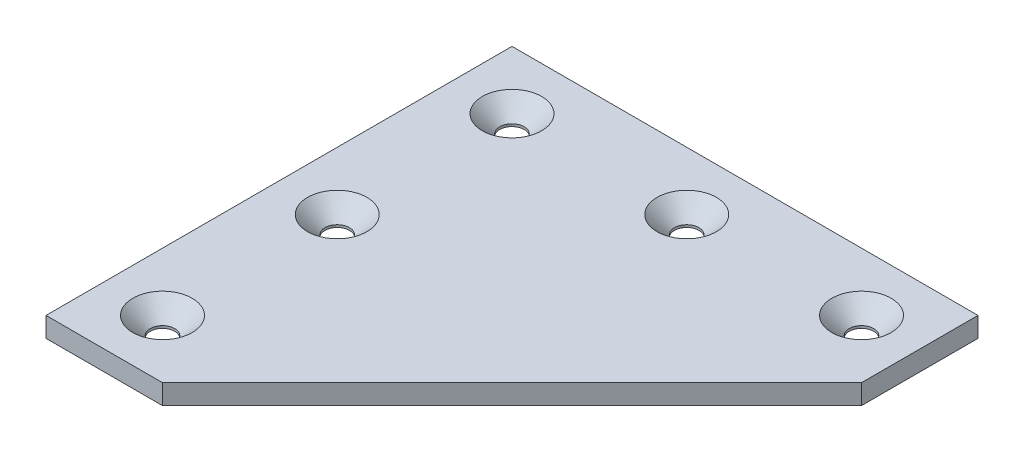
ISO-10303-21;
HEADER;
FILE_DESCRIPTION(('STEP AP214'),'2;1');
FILE_NAME('part.step','',(''),(''),'','','');
FILE_SCHEMA(('AUTOMOTIVE_DESIGN { 1 0 10303 214 1 1 1 1 }'));
ENDSEC;
DATA;
#1=APPLICATION_CONTEXT('core data for automotive mechanical design processes');
#2=APPLICATION_PROTOCOL_DEFINITION('international standard','automotive_design',2000,#1);
#3=PRODUCT_CONTEXT('',#1,'mechanical');
#4=PRODUCT('Part','Part','',(#3));
#5=PRODUCT_RELATED_PRODUCT_CATEGORY('part','',(#4));
#6=PRODUCT_DEFINITION_FORMATION('','',#4);
#7=PRODUCT_DEFINITION_CONTEXT('part definition',#1,'design');
#8=PRODUCT_DEFINITION('design','',#6,#7);
#9=PRODUCT_DEFINITION_SHAPE('','',#8);
#10=(LENGTH_UNIT() NAMED_UNIT(*) SI_UNIT(.MILLI.,.METRE.));
#11=(NAMED_UNIT(*) PLANE_ANGLE_UNIT() SI_UNIT($,.RADIAN.));
#12=(NAMED_UNIT(*) SI_UNIT($,.STERADIAN.) SOLID_ANGLE_UNIT());
#13=UNCERTAINTY_MEASURE_WITH_UNIT(LENGTH_MEASURE(1.E-05),#10,'distance_accuracy_value','');
#14=(GEOMETRIC_REPRESENTATION_CONTEXT(3) GLOBAL_UNCERTAINTY_ASSIGNED_CONTEXT((#13)) GLOBAL_UNIT_ASSIGNED_CONTEXT((#10,
#11,#12)) REPRESENTATION_CONTEXT('',''));
#15=CARTESIAN_POINT('',(0.,0.,0.));
#16=DIRECTION('',(0.,0.,1.));
#17=DIRECTION('',(1.,0.,0.));
#18=AXIS2_PLACEMENT_3D('',#15,#16,#17);
#19=CARTESIAN_POINT('',(80.,3.416,0.));
#20=DIRECTION('',(0.,0.,1.));
#21=DIRECTION('',(-1.,0.,0.));
#22=AXIS2_PLACEMENT_3D('',#19,#20,#21);
#23=PLANE('',#22);
#24=DIRECTION('',(1.,0.,0.));
#25=VECTOR('',#24,1.);
#26=CARTESIAN_POINT('',(80.,0.,0.));
#27=LINE('',#26,#25);
#28=CARTESIAN_POINT('',(0.,0.,0.));
#29=VERTEX_POINT('',#28);
#30=CARTESIAN_POINT('',(80.,0.,0.));
#31=VERTEX_POINT('',#30);
#32=EDGE_CURVE('E118',#29,#31,#27,.T.);
#33=ORIENTED_EDGE('',*,*,#32,.F.);
#34=DIRECTION('',(0.,-1.,0.));
#35=VECTOR('',#34,1.);
#36=CARTESIAN_POINT('',(0.,3.416,0.));
#37=LINE('',#36,#35);
#38=CARTESIAN_POINT('',(0.,3.416,0.));
#39=VERTEX_POINT('',#38);
#40=EDGE_CURVE('E117',#39,#29,#37,.T.);
#41=ORIENTED_EDGE('',*,*,#40,.F.);
#42=DIRECTION('',(1.,0.,0.));
#43=VECTOR('',#42,1.);
#44=CARTESIAN_POINT('',(80.,3.416,0.));
#45=LINE('',#44,#43);
#46=CARTESIAN_POINT('',(80.,3.416,0.));
#47=VERTEX_POINT('',#46);
#48=EDGE_CURVE('E112',#39,#47,#45,.T.);
#49=ORIENTED_EDGE('',*,*,#48,.T.);
#50=DIRECTION('',(0.,-1.,0.));
#51=VECTOR('',#50,1.);
#52=CARTESIAN_POINT('',(80.,3.416,0.));
#53=LINE('',#52,#51);
#54=EDGE_CURVE('E131',#47,#31,#53,.T.);
#55=ORIENTED_EDGE('',*,*,#54,.T.);
#56=EDGE_LOOP('',(#33,#41,#49,#55));
#57=FACE_BOUND('',#56,.T.);
#58=ADVANCED_FACE('F41',(#57),#23,.F.);
#59=CARTESIAN_POINT('',(80.,3.416,20.));
#60=DIRECTION('',(-1.,0.,0.));
#61=DIRECTION('',(0.,0.,-1.));
#62=AXIS2_PLACEMENT_3D('',#59,#60,#61);
#63=PLANE('',#62);
#64=DIRECTION('',(0.,0.,1.));
#65=VECTOR('',#64,1.);
#66=CARTESIAN_POINT('',(80.,0.,20.));
#67=LINE('',#66,#65);
#68=CARTESIAN_POINT('',(80.,0.,20.));
#69=VERTEX_POINT('',#68);
#70=EDGE_CURVE('E120',#31,#69,#67,.T.);
#71=ORIENTED_EDGE('',*,*,#70,.F.);
#72=ORIENTED_EDGE('',*,*,#54,.F.);
#73=DIRECTION('',(0.,0.,1.));
#74=VECTOR('',#73,1.);
#75=CARTESIAN_POINT('',(80.,3.416,20.));
#76=LINE('',#75,#74);
#77=CARTESIAN_POINT('',(80.,3.416,20.));
#78=VERTEX_POINT('',#77);
#79=EDGE_CURVE('E87',#47,#78,#76,.T.);
#80=ORIENTED_EDGE('',*,*,#79,.T.);
#81=DIRECTION('',(0.,-1.,0.));
#82=VECTOR('',#81,1.);
#83=CARTESIAN_POINT('',(80.,3.416,20.));
#84=LINE('',#83,#82);
#85=EDGE_CURVE('E106',#78,#69,#84,.T.);
#86=ORIENTED_EDGE('',*,*,#85,.T.);
#87=EDGE_LOOP('',(#71,#72,#80,#86));
#88=FACE_BOUND('',#87,.T.);
#89=ADVANCED_FACE('F200',(#88),#63,.F.);
#90=CARTESIAN_POINT('',(20.,3.416,79.9999999999998));
#91=DIRECTION('',(-0.707106781186546,0.,-0.707106781186549));
#92=DIRECTION('',(0.707106781186549,0.,-0.707106781186546));
#93=AXIS2_PLACEMENT_3D('',#90,#91,#92);
#94=PLANE('',#93);
#95=DIRECTION('',(-0.707106781186549,0.,0.707106781186546));
#96=VECTOR('',#95,1.);
#97=CARTESIAN_POINT('',(20.,0.,79.9999999999998));
#98=LINE('',#97,#96);
#99=CARTESIAN_POINT('',(20.,0.,79.9999999999998));
#100=VERTEX_POINT('',#99);
#101=EDGE_CURVE('E124',#69,#100,#98,.T.);
#102=ORIENTED_EDGE('',*,*,#101,.F.);
#103=ORIENTED_EDGE('',*,*,#85,.F.);
#104=DIRECTION('',(-0.707106781186549,0.,0.707106781186546));
#105=VECTOR('',#104,1.);
#106=CARTESIAN_POINT('',(20.,3.416,79.9999999999998));
#107=LINE('',#106,#105);
#108=CARTESIAN_POINT('',(20.,3.416,79.9999999999998));
#109=VERTEX_POINT('',#108);
#110=EDGE_CURVE('E96',#78,#109,#107,.T.);
#111=ORIENTED_EDGE('',*,*,#110,.T.);
#112=DIRECTION('',(0.,-1.,0.));
#113=VECTOR('',#112,1.);
#114=CARTESIAN_POINT('',(20.,3.416,79.9999999999998));
#115=LINE('',#114,#113);
#116=EDGE_CURVE('E101',#109,#100,#115,.T.);
#117=ORIENTED_EDGE('',*,*,#116,.T.);
#118=EDGE_LOOP('',(#102,#103,#111,#117));
#119=FACE_BOUND('',#118,.T.);
#120=ADVANCED_FACE('F109',(#119),#94,.F.);
#121=CARTESIAN_POINT('',(0.,3.416,79.9999999999998));
#122=DIRECTION('',(0.,0.,-1.));
#123=DIRECTION('',(1.,0.,0.));
#124=AXIS2_PLACEMENT_3D('',#121,#122,#123);
#125=PLANE('',#124);
#126=DIRECTION('',(-1.,0.,0.));
#127=VECTOR('',#126,1.);
#128=CARTESIAN_POINT('',(0.,0.,79.9999999999998));
#129=LINE('',#128,#127);
#130=CARTESIAN_POINT('',(0.,0.,79.9999999999998));
#131=VERTEX_POINT('',#130);
#132=EDGE_CURVE('E103',#100,#131,#129,.T.);
#133=ORIENTED_EDGE('',*,*,#132,.F.);
#134=ORIENTED_EDGE('',*,*,#116,.F.);
#135=DIRECTION('',(-1.,0.,0.));
#136=VECTOR('',#135,1.);
#137=CARTESIAN_POINT('',(0.,3.416,79.9999999999998));
#138=LINE('',#137,#136);
#139=CARTESIAN_POINT('',(0.,3.416,79.9999999999998));
#140=VERTEX_POINT('',#139);
#141=EDGE_CURVE('E92',#109,#140,#138,.T.);
#142=ORIENTED_EDGE('',*,*,#141,.T.);
#143=DIRECTION('',(0.,-1.,0.));
#144=VECTOR('',#143,1.);
#145=CARTESIAN_POINT('',(0.,3.416,79.9999999999998));
#146=LINE('',#145,#144);
#147=EDGE_CURVE('E107',#140,#131,#146,.T.);
#148=ORIENTED_EDGE('',*,*,#147,.T.);
#149=EDGE_LOOP('',(#133,#134,#142,#148));
#150=FACE_BOUND('',#149,.T.);
#151=ADVANCED_FACE('F102',(#150),#125,.F.);
#152=CARTESIAN_POINT('',(0.,3.416,0.));
#153=DIRECTION('',(1.,0.,0.));
#154=DIRECTION('',(0.,0.,1.));
#155=AXIS2_PLACEMENT_3D('',#152,#153,#154);
#156=PLANE('',#155);
#157=DIRECTION('',(0.,0.,-1.));
#158=VECTOR('',#157,1.);
#159=CARTESIAN_POINT('',(0.,0.,0.));
#160=LINE('',#159,#158);
#161=EDGE_CURVE('E75',#131,#29,#160,.T.);
#162=ORIENTED_EDGE('',*,*,#161,.F.);
#163=ORIENTED_EDGE('',*,*,#147,.F.);
#164=DIRECTION('',(0.,0.,-1.));
#165=VECTOR('',#164,1.);
#166=CARTESIAN_POINT('',(0.,3.416,0.));
#167=LINE('',#166,#165);
#168=EDGE_CURVE('E58',#140,#39,#167,.T.);
#169=ORIENTED_EDGE('',*,*,#168,.T.);
#170=ORIENTED_EDGE('',*,*,#40,.T.);
#171=EDGE_LOOP('',(#162,#163,#169,#170));
#172=FACE_BOUND('',#171,.T.);
#173=ADVANCED_FACE('F232',(#172),#156,.F.);
#174=CARTESIAN_POINT('',(0.,3.416,0.));
#175=DIRECTION('',(0.,-1.,0.));
#176=DIRECTION('',(0.,0.,1.));
#177=AXIS2_PLACEMENT_3D('',#174,#175,#176);
#178=PLANE('',#177);
#179=CARTESIAN_POINT('',(70.,3.416,10.));
#180=DIRECTION('',(0.,1.,0.));
#181=DIRECTION('',(0.,0.,1.));
#182=AXIS2_PLACEMENT_3D('',#179,#180,#181);
#183=CIRCLE('',#182,5.10000000000001);
#184=CARTESIAN_POINT('',(70.,3.416,15.1));
#185=VERTEX_POINT('',#184);
#186=EDGE_CURVE('E163',#185,#185,#183,.T.);
#187=ORIENTED_EDGE('',*,*,#186,.F.);
#188=EDGE_LOOP('',(#187));
#189=FACE_BOUND('',#188,.T.);
#190=CARTESIAN_POINT('',(40.,3.416,10.));
#191=DIRECTION('',(0.,1.,0.));
#192=DIRECTION('',(0.,0.,1.));
#193=AXIS2_PLACEMENT_3D('',#190,#191,#192);
#194=CIRCLE('',#193,5.10000000000001);
#195=CARTESIAN_POINT('',(40.,3.416,15.1));
#196=VERTEX_POINT('',#195);
#197=EDGE_CURVE('E160',#196,#196,#194,.T.);
#198=ORIENTED_EDGE('',*,*,#197,.F.);
#199=EDGE_LOOP('',(#198));
#200=FACE_BOUND('',#199,.T.);
#201=CARTESIAN_POINT('',(10.,3.416,10.));
#202=DIRECTION('',(0.,1.,0.));
#203=DIRECTION('',(0.,0.,1.));
#204=AXIS2_PLACEMENT_3D('',#201,#202,#203);
#205=CIRCLE('',#204,5.10000000000002);
#206=CARTESIAN_POINT('',(10.,3.416,15.1));
#207=VERTEX_POINT('',#206);
#208=EDGE_CURVE('E157',#207,#207,#205,.T.);
#209=ORIENTED_EDGE('',*,*,#208,.F.);
#210=EDGE_LOOP('',(#209));
#211=FACE_BOUND('',#210,.T.);
#212=CARTESIAN_POINT('',(9.9999999999999,3.416,40.));
#213=DIRECTION('',(0.,1.,0.));
#214=DIRECTION('',(0.,0.,1.));
#215=AXIS2_PLACEMENT_3D('',#212,#213,#214);
#216=CIRCLE('',#215,5.10000000000001);
#217=CARTESIAN_POINT('',(9.9999999999999,3.416,45.1));
#218=VERTEX_POINT('',#217);
#219=EDGE_CURVE('E154',#218,#218,#216,.T.);
#220=ORIENTED_EDGE('',*,*,#219,.F.);
#221=EDGE_LOOP('',(#220));
#222=FACE_BOUND('',#221,.T.);
#223=CARTESIAN_POINT('',(9.99999999999979,3.416,70.));
#224=DIRECTION('',(0.,1.,0.));
#225=DIRECTION('',(0.,0.,1.));
#226=AXIS2_PLACEMENT_3D('',#223,#224,#225);
#227=CIRCLE('',#226,5.10000000000001);
#228=CARTESIAN_POINT('',(9.99999999999979,3.416,64.9));
#229=VERTEX_POINT('',#228);
#230=EDGE_CURVE('E151',#229,#229,#227,.T.);
#231=ORIENTED_EDGE('',*,*,#230,.F.);
#232=EDGE_LOOP('',(#231));
#233=FACE_BOUND('',#232,.T.);
#234=ORIENTED_EDGE('',*,*,#48,.F.);
#235=ORIENTED_EDGE('',*,*,#168,.F.);
#236=ORIENTED_EDGE('',*,*,#141,.F.);
#237=ORIENTED_EDGE('',*,*,#110,.F.);
#238=ORIENTED_EDGE('',*,*,#79,.F.);
#239=EDGE_LOOP('',(#234,#235,#236,#237,#238));
#240=FACE_BOUND('',#239,.T.);
#241=ADVANCED_FACE('F94',(#189,#200,#211,#222,#233,#240),#178,.F.);
#242=CARTESIAN_POINT('',(0.,0.,0.));
#243=DIRECTION('',(0.,-1.,0.));
#244=DIRECTION('',(0.,0.,1.));
#245=AXIS2_PLACEMENT_3D('',#242,#243,#244);
#246=PLANE('',#245);
#247=CARTESIAN_POINT('',(9.99999999999979,0.,70.));
#248=DIRECTION('',(0.,1.,0.));
#249=DIRECTION('',(0.,0.,1.));
#250=AXIS2_PLACEMENT_3D('',#247,#248,#249);
#251=CIRCLE('',#250,2.1);
#252=CARTESIAN_POINT('',(9.99999999999979,0.,72.1));
#253=VERTEX_POINT('',#252);
#254=EDGE_CURVE('E121',#253,#253,#251,.T.);
#255=ORIENTED_EDGE('',*,*,#254,.T.);
#256=EDGE_LOOP('',(#255));
#257=FACE_BOUND('',#256,.T.);
#258=CARTESIAN_POINT('',(9.9999999999999,0.,40.));
#259=DIRECTION('',(0.,1.,0.));
#260=DIRECTION('',(0.,0.,1.));
#261=AXIS2_PLACEMENT_3D('',#258,#259,#260);
#262=CIRCLE('',#261,2.1);
#263=CARTESIAN_POINT('',(9.9999999999999,0.,42.1));
#264=VERTEX_POINT('',#263);
#265=EDGE_CURVE('E144',#264,#264,#262,.T.);
#266=ORIENTED_EDGE('',*,*,#265,.T.);
#267=EDGE_LOOP('',(#266));
#268=FACE_BOUND('',#267,.T.);
#269=CARTESIAN_POINT('',(70.,0.,10.));
#270=DIRECTION('',(0.,1.,0.));
#271=DIRECTION('',(0.,0.,1.));
#272=AXIS2_PLACEMENT_3D('',#269,#270,#271);
#273=CIRCLE('',#272,2.1);
#274=CARTESIAN_POINT('',(70.,0.,12.1));
#275=VERTEX_POINT('',#274);
#276=EDGE_CURVE('E141',#275,#275,#273,.T.);
#277=ORIENTED_EDGE('',*,*,#276,.T.);
#278=EDGE_LOOP('',(#277));
#279=FACE_BOUND('',#278,.T.);
#280=CARTESIAN_POINT('',(10.,0.,10.));
#281=DIRECTION('',(0.,1.,0.));
#282=DIRECTION('',(0.,0.,1.));
#283=AXIS2_PLACEMENT_3D('',#280,#281,#282);
#284=CIRCLE('',#283,2.1);
#285=CARTESIAN_POINT('',(10.,0.,12.1));
#286=VERTEX_POINT('',#285);
#287=EDGE_CURVE('E138',#286,#286,#284,.T.);
#288=ORIENTED_EDGE('',*,*,#287,.T.);
#289=EDGE_LOOP('',(#288));
#290=FACE_BOUND('',#289,.T.);
#291=CARTESIAN_POINT('',(40.,0.,10.));
#292=DIRECTION('',(0.,1.,0.));
#293=DIRECTION('',(0.,0.,1.));
#294=AXIS2_PLACEMENT_3D('',#291,#292,#293);
#295=CIRCLE('',#294,2.1);
#296=CARTESIAN_POINT('',(40.,0.,12.1));
#297=VERTEX_POINT('',#296);
#298=EDGE_CURVE('E135',#297,#297,#295,.T.);
#299=ORIENTED_EDGE('',*,*,#298,.T.);
#300=EDGE_LOOP('',(#299));
#301=FACE_BOUND('',#300,.T.);
#302=ORIENTED_EDGE('',*,*,#32,.T.);
#303=ORIENTED_EDGE('',*,*,#70,.T.);
#304=ORIENTED_EDGE('',*,*,#101,.T.);
#305=ORIENTED_EDGE('',*,*,#132,.T.);
#306=ORIENTED_EDGE('',*,*,#161,.T.);
#307=EDGE_LOOP('',(#302,#303,#304,#305,#306));
#308=FACE_BOUND('',#307,.T.);
#309=ADVANCED_FACE('F184',(#257,#268,#279,#290,#301,#308),#246,.T.);
#310=CARTESIAN_POINT('',(40.,-0.584,10.));
#311=DIRECTION('',(0.,1.,0.));
#312=DIRECTION('',(0.,0.,-1.));
#313=AXIS2_PLACEMENT_3D('',#310,#311,#312);
#314=CYLINDRICAL_SURFACE('',#313,2.1);
#315=CARTESIAN_POINT('',(40.,0.415999999999996,10.));
#316=DIRECTION('',(0.,1.,0.));
#317=DIRECTION('',(0.,0.,1.));
#318=AXIS2_PLACEMENT_3D('',#315,#316,#317);
#319=CIRCLE('',#318,2.1);
#320=CARTESIAN_POINT('',(40.,0.415999999999996,12.1));
#321=VERTEX_POINT('',#320);
#322=EDGE_CURVE('E166',#321,#321,#319,.F.);
#323=ORIENTED_EDGE('',*,*,#322,.F.);
#324=EDGE_LOOP('',(#323));
#325=FACE_BOUND('',#324,.T.);
#326=ORIENTED_EDGE('',*,*,#298,.F.);
#327=EDGE_LOOP('',(#326));
#328=FACE_BOUND('',#327,.T.);
#329=ADVANCED_FACE('F187',(#325,#328),#314,.F.);
#330=CARTESIAN_POINT('',(10.,-0.584,10.));
#331=DIRECTION('',(0.,1.,0.));
#332=DIRECTION('',(0.,0.,-1.));
#333=AXIS2_PLACEMENT_3D('',#330,#331,#332);
#334=CYLINDRICAL_SURFACE('',#333,2.1);
#335=CARTESIAN_POINT('',(10.,0.415999999999984,10.));
#336=DIRECTION('',(0.,1.,0.));
#337=DIRECTION('',(0.,0.,1.));
#338=AXIS2_PLACEMENT_3D('',#335,#336,#337);
#339=CIRCLE('',#338,2.1);
#340=CARTESIAN_POINT('',(10.,0.415999999999984,12.1));
#341=VERTEX_POINT('',#340);
#342=EDGE_CURVE('E169',#341,#341,#339,.F.);
#343=ORIENTED_EDGE('',*,*,#342,.F.);
#344=EDGE_LOOP('',(#343));
#345=FACE_BOUND('',#344,.T.);
#346=ORIENTED_EDGE('',*,*,#287,.F.);
#347=EDGE_LOOP('',(#346));
#348=FACE_BOUND('',#347,.T.);
#349=ADVANCED_FACE('F248',(#345,#348),#334,.F.);
#350=CARTESIAN_POINT('',(70.,-0.584,10.));
#351=DIRECTION('',(0.,1.,0.));
#352=DIRECTION('',(0.,0.,-1.));
#353=AXIS2_PLACEMENT_3D('',#350,#351,#352);
#354=CYLINDRICAL_SURFACE('',#353,2.1);
#355=CARTESIAN_POINT('',(70.,0.416000000000003,10.));
#356=DIRECTION('',(0.,1.,0.));
#357=DIRECTION('',(0.,0.,1.));
#358=AXIS2_PLACEMENT_3D('',#355,#356,#357);
#359=CIRCLE('',#358,2.1);
#360=CARTESIAN_POINT('',(70.,0.416000000000003,12.1));
#361=VERTEX_POINT('',#360);
#362=EDGE_CURVE('E134',#361,#361,#359,.F.);
#363=ORIENTED_EDGE('',*,*,#362,.F.);
#364=EDGE_LOOP('',(#363));
#365=FACE_BOUND('',#364,.T.);
#366=ORIENTED_EDGE('',*,*,#276,.F.);
#367=EDGE_LOOP('',(#366));
#368=FACE_BOUND('',#367,.T.);
#369=ADVANCED_FACE('F180',(#365,#368),#354,.F.);
#370=CARTESIAN_POINT('',(9.9999999999999,-0.584,40.));
#371=DIRECTION('',(0.,1.,0.));
#372=DIRECTION('',(0.,0.,-1.));
#373=AXIS2_PLACEMENT_3D('',#370,#371,#372);
#374=CYLINDRICAL_SURFACE('',#373,2.1);
#375=CARTESIAN_POINT('',(9.9999999999999,0.415999999999997,40.));
#376=DIRECTION('',(0.,1.,0.));
#377=DIRECTION('',(0.,0.,1.));
#378=AXIS2_PLACEMENT_3D('',#375,#376,#377);
#379=CIRCLE('',#378,2.1);
#380=CARTESIAN_POINT('',(9.9999999999999,0.415999999999997,42.1));
#381=VERTEX_POINT('',#380);
#382=EDGE_CURVE('E50',#381,#381,#379,.F.);
#383=ORIENTED_EDGE('',*,*,#382,.F.);
#384=EDGE_LOOP('',(#383));
#385=FACE_BOUND('',#384,.T.);
#386=ORIENTED_EDGE('',*,*,#265,.F.);
#387=EDGE_LOOP('',(#386));
#388=FACE_BOUND('',#387,.T.);
#389=ADVANCED_FACE('F176',(#385,#388),#374,.F.);
#390=CARTESIAN_POINT('',(9.99999999999979,-0.584,70.));
#391=DIRECTION('',(0.,1.,0.));
#392=DIRECTION('',(0.,0.,-1.));
#393=AXIS2_PLACEMENT_3D('',#390,#391,#392);
#394=CYLINDRICAL_SURFACE('',#393,2.1);
#395=CARTESIAN_POINT('',(9.99999999999979,0.415999999999999,70.));
#396=DIRECTION('',(0.,1.,0.));
#397=DIRECTION('',(0.,0.,1.));
#398=AXIS2_PLACEMENT_3D('',#395,#396,#397);
#399=CIRCLE('',#398,2.1);
#400=CARTESIAN_POINT('',(9.99999999999979,0.415999999999999,67.9));
#401=VERTEX_POINT('',#400);
#402=EDGE_CURVE('E11',#401,#401,#399,.F.);
#403=ORIENTED_EDGE('',*,*,#402,.F.);
#404=EDGE_LOOP('',(#403));
#405=FACE_BOUND('',#404,.T.);
#406=ORIENTED_EDGE('',*,*,#254,.F.);
#407=EDGE_LOOP('',(#406));
#408=FACE_BOUND('',#407,.T.);
#409=ADVANCED_FACE('F179',(#405,#408),#394,.F.);
#410=CARTESIAN_POINT('',(70.,0.416000000000003,10.));
#411=DIRECTION('',(0.,1.,0.));
#412=DIRECTION('',(0.,0.,-1.));
#413=AXIS2_PLACEMENT_3D('',#410,#411,#412);
#414=CONICAL_SURFACE('',#413,2.1,0.785398163397449);
#415=ORIENTED_EDGE('',*,*,#186,.T.);
#416=EDGE_LOOP('',(#415));
#417=FACE_BOUND('',#416,.T.);
#418=ORIENTED_EDGE('',*,*,#362,.T.);
#419=EDGE_LOOP('',(#418));
#420=FACE_BOUND('',#419,.T.);
#421=ADVANCED_FACE('F211',(#417,#420),#414,.F.);
#422=CARTESIAN_POINT('',(40.,0.415999999999996,10.));
#423=DIRECTION('',(0.,1.,0.));
#424=DIRECTION('',(0.,0.,-1.));
#425=AXIS2_PLACEMENT_3D('',#422,#423,#424);
#426=CONICAL_SURFACE('',#425,2.1,0.785398163397449);
#427=ORIENTED_EDGE('',*,*,#197,.T.);
#428=EDGE_LOOP('',(#427));
#429=FACE_BOUND('',#428,.T.);
#430=ORIENTED_EDGE('',*,*,#322,.T.);
#431=EDGE_LOOP('',(#430));
#432=FACE_BOUND('',#431,.T.);
#433=ADVANCED_FACE('F214',(#429,#432),#426,.F.);
#434=CARTESIAN_POINT('',(10.,0.415999999999984,10.));
#435=DIRECTION('',(0.,1.,0.));
#436=DIRECTION('',(0.,0.,-1.));
#437=AXIS2_PLACEMENT_3D('',#434,#435,#436);
#438=CONICAL_SURFACE('',#437,2.1,0.78539816339745);
#439=ORIENTED_EDGE('',*,*,#208,.T.);
#440=EDGE_LOOP('',(#439));
#441=FACE_BOUND('',#440,.T.);
#442=ORIENTED_EDGE('',*,*,#342,.T.);
#443=EDGE_LOOP('',(#442));
#444=FACE_BOUND('',#443,.T.);
#445=ADVANCED_FACE('F218',(#441,#444),#438,.F.);
#446=CARTESIAN_POINT('',(9.9999999999999,0.415999999999997,40.));
#447=DIRECTION('',(0.,1.,0.));
#448=DIRECTION('',(0.,0.,-1.));
#449=AXIS2_PLACEMENT_3D('',#446,#447,#448);
#450=CONICAL_SURFACE('',#449,2.1,0.785398163397449);
#451=ORIENTED_EDGE('',*,*,#219,.T.);
#452=EDGE_LOOP('',(#451));
#453=FACE_BOUND('',#452,.T.);
#454=ORIENTED_EDGE('',*,*,#382,.T.);
#455=EDGE_LOOP('',(#454));
#456=FACE_BOUND('',#455,.T.);
#457=ADVANCED_FACE('F174',(#453,#456),#450,.F.);
#458=CARTESIAN_POINT('',(9.99999999999979,0.415999999999999,70.));
#459=DIRECTION('',(0.,1.,0.));
#460=DIRECTION('',(0.,0.,-1.));
#461=AXIS2_PLACEMENT_3D('',#458,#459,#460);
#462=CONICAL_SURFACE('',#461,2.1,0.785398163397449);
#463=CARTESIAN_POINT('',(9.99999999999979,3.416,64.9));
#464=CARTESIAN_POINT('',(9.99999999999979,3.38475,64.93125));
#465=CARTESIAN_POINT('',(9.99999999999979,3.3535,64.9625));
#466=CARTESIAN_POINT('',(9.99999999999979,3.291,65.025));
#467=CARTESIAN_POINT('',(9.99999999999979,3.25975,65.05625));
#468=CARTESIAN_POINT('',(9.99999999999979,3.19725,65.11875));
#469=CARTESIAN_POINT('',(9.99999999999979,3.166,65.15));
#470=CARTESIAN_POINT('',(9.99999999999979,3.1035,65.2125));
#471=CARTESIAN_POINT('',(9.99999999999979,3.07225,65.24375));
#472=CARTESIAN_POINT('',(9.99999999999979,3.00975,65.30625));
#473=CARTESIAN_POINT('',(9.99999999999979,2.9785,65.3375));
#474=CARTESIAN_POINT('',(9.99999999999979,2.916,65.4));
#475=CARTESIAN_POINT('',(9.99999999999979,2.88475,65.43125));
#476=CARTESIAN_POINT('',(9.99999999999979,2.82225,65.49375));
#477=CARTESIAN_POINT('',(9.99999999999979,2.791,65.525));
#478=CARTESIAN_POINT('',(9.99999999999979,2.7285,65.5875));
#479=CARTESIAN_POINT('',(9.99999999999979,2.69725,65.61875));
#480=CARTESIAN_POINT('',(9.99999999999979,2.63475,65.68125));
#481=CARTESIAN_POINT('',(9.99999999999979,2.6035,65.7125));
#482=CARTESIAN_POINT('',(9.99999999999979,2.541,65.775));
#483=CARTESIAN_POINT('',(9.99999999999979,2.50975,65.80625));
#484=CARTESIAN_POINT('',(9.99999999999979,2.44725,65.86875));
#485=CARTESIAN_POINT('',(9.99999999999979,2.416,65.9));
#486=CARTESIAN_POINT('',(9.99999999999979,2.3535,65.9625));
#487=CARTESIAN_POINT('',(9.99999999999979,2.32225,65.99375));
#488=CARTESIAN_POINT('',(9.99999999999979,2.25975,66.05625));
#489=CARTESIAN_POINT('',(9.99999999999979,2.2285,66.0875));
#490=CARTESIAN_POINT('',(9.99999999999979,2.166,66.15));
#491=CARTESIAN_POINT('',(9.99999999999979,2.13475,66.18125));
#492=CARTESIAN_POINT('',(9.99999999999979,2.07225,66.24375));
#493=CARTESIAN_POINT('',(9.99999999999979,2.041,66.275));
#494=CARTESIAN_POINT('',(9.99999999999979,1.9785,66.3375));
#495=CARTESIAN_POINT('',(9.99999999999979,1.94725,66.36875));
#496=CARTESIAN_POINT('',(9.99999999999979,1.88475,66.43125));
#497=CARTESIAN_POINT('',(9.99999999999979,1.8535,66.4625));
#498=CARTESIAN_POINT('',(9.99999999999979,1.791,66.525));
#499=CARTESIAN_POINT('',(9.99999999999979,1.75975,66.55625));
#500=CARTESIAN_POINT('',(9.99999999999979,1.69725,66.61875));
#501=CARTESIAN_POINT('',(9.99999999999979,1.666,66.65));
#502=CARTESIAN_POINT('',(9.99999999999979,1.6035,66.7125));
#503=CARTESIAN_POINT('',(9.99999999999979,1.57225,66.74375));
#504=CARTESIAN_POINT('',(9.99999999999979,1.50975,66.80625));
#505=CARTESIAN_POINT('',(9.99999999999979,1.4785,66.8375));
#506=CARTESIAN_POINT('',(9.99999999999979,1.416,66.9));
#507=CARTESIAN_POINT('',(9.99999999999979,1.38475,66.93125));
#508=CARTESIAN_POINT('',(9.99999999999979,1.32225,66.99375));
#509=CARTESIAN_POINT('',(9.99999999999979,1.291,67.025));
#510=CARTESIAN_POINT('',(9.99999999999979,1.2285,67.0875));
#511=CARTESIAN_POINT('',(9.99999999999979,1.19725,67.11875));
#512=CARTESIAN_POINT('',(9.99999999999979,1.13475,67.18125));
#513=CARTESIAN_POINT('',(9.99999999999979,1.1035,67.2125));
#514=CARTESIAN_POINT('',(9.99999999999979,1.041,67.275));
#515=CARTESIAN_POINT('',(9.99999999999979,1.00975,67.30625));
#516=CARTESIAN_POINT('',(9.99999999999979,0.94725,67.36875));
#517=CARTESIAN_POINT('',(9.99999999999979,0.916000000000001,67.4));
#518=CARTESIAN_POINT('',(9.99999999999979,0.8535,67.4625));
#519=CARTESIAN_POINT('',(9.99999999999979,0.822249999999999,67.49375));
#520=CARTESIAN_POINT('',(9.99999999999979,0.759749999999998,67.55625));
#521=CARTESIAN_POINT('',(9.99999999999979,0.728499999999999,67.5875));
#522=CARTESIAN_POINT('',(9.99999999999979,0.666,67.65));
#523=CARTESIAN_POINT('',(9.99999999999979,0.634749999999999,67.68125));
#524=CARTESIAN_POINT('',(9.99999999999979,0.572249999999999,67.74375));
#525=CARTESIAN_POINT('',(9.99999999999979,0.541,67.775));
#526=CARTESIAN_POINT('',(9.99999999999979,0.478500000000001,67.8375));
#527=CARTESIAN_POINT('',(9.99999999999979,0.447250000000002,67.86875));
#528=CARTESIAN_POINT('',(9.99999999999979,0.415999999999999,67.9));
#529=B_SPLINE_CURVE_WITH_KNOTS('',3,(#463,#464,#465,#466,#467,#468,#469,#470,#471,#472,#473,
#474,#475,#476,#477,#478,#479,#480,#481,#482,#483,#484,#485,#486,#487,#488,#489,#490,#491,#492,
#493,#494,#495,#496,#497,#498,#499,#500,#501,#502,#503,#504,#505,#506,#507,#508,#509,#510,#511,
#512,#513,#514,#515,#516,#517,#518,#519,#520,#521,#522,#523,#524,#525,#526,#527,#528),
.UNSPECIFIED.,.F.,.F.,(4,2,2,2,2,2,2,2,2,2,2,2,2,2,2,2,2,2,2,2,2,2,2,2,2,2,2,2,2,2,2,2,4),(0.,
0.13258252147248,0.26516504294496,0.397747564417431,0.530330085889911,0.662912607362391,
0.795495128834861,0.928077650307342,1.06066017177982,1.1932426932523,1.32582521472478,
1.45840773619725,1.59099025766973,1.72357277914221,1.85615530061469,1.98873782208716,
2.12132034355964,2.25390286503212,2.3864853865046,2.51906790797707,2.65165042944955,
2.78423295092203,2.91681547239452,3.04939799386699,3.18198051533947,3.31456303681195,
3.44714555828443,3.57972807975691,3.71231060122938,3.84489312270186,3.97747564417434,
4.11005816564682,4.24264068711929),.UNSPECIFIED.);
#530=EDGE_CURVE('BSEAM43',#229,#401,#529,.T.);
#531=ORIENTED_EDGE('',*,*,#230,.T.);
#532=ORIENTED_EDGE('',*,*,#402,.T.);
#533=ORIENTED_EDGE('',*,*,#530,.T.);
#534=ORIENTED_EDGE('',*,*,#530,.F.);
#535=EDGE_LOOP('',(#531,#533,#532,#534));
#536=FACE_BOUND('',#535,.T.);
#537=ADVANCED_FACE('F43',(#536),#462,.F.);
#538=CLOSED_SHELL('',(#58,#89,#120,#151,#173,#241,#309,#329,#349,#369,#389,#409,#421,#433,#445,
#457,#537));
#539=MANIFOLD_SOLID_BREP('B2',#538);
#540=ADVANCED_BREP_SHAPE_REPRESENTATION('',(#18,#539),#14);
#541=SHAPE_DEFINITION_REPRESENTATION(#9,#540);
ENDSEC;
END-ISO-10303-21;
